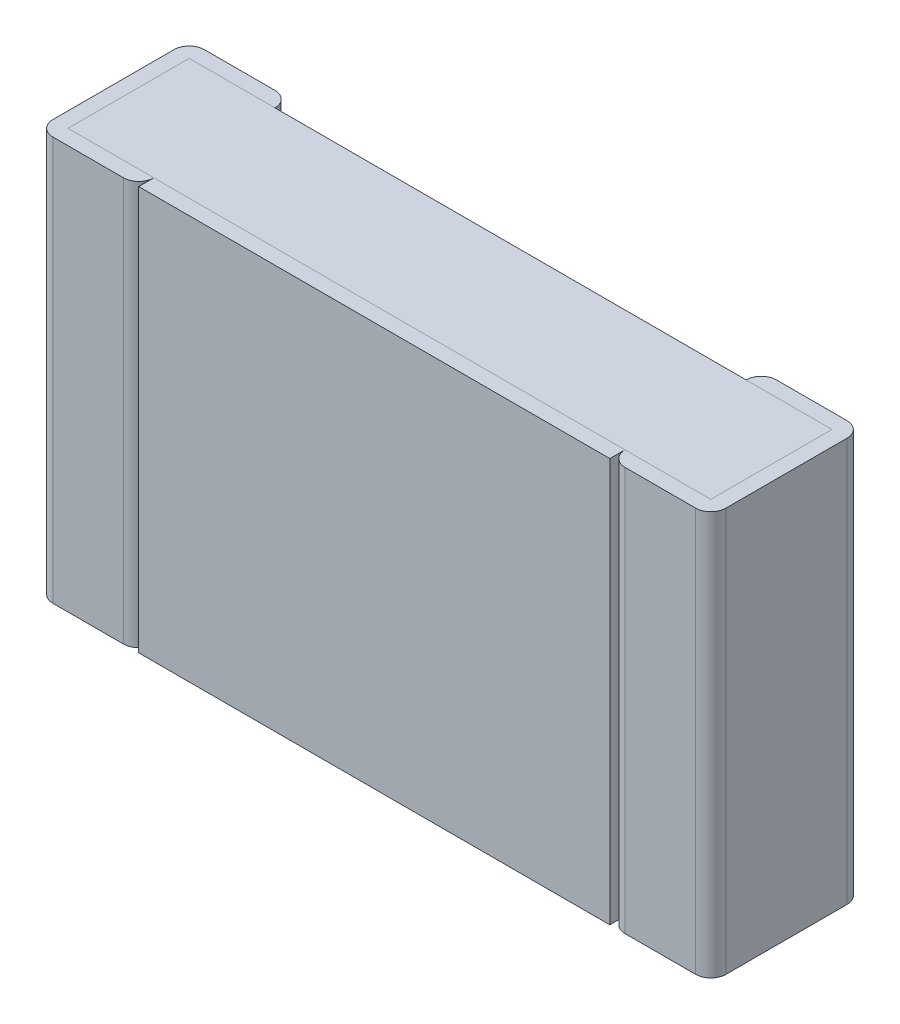
ISO-10303-21;
HEADER;
FILE_DESCRIPTION(('STEP AP214'),'2;1');
FILE_NAME('part.step','',(''),(''),'','','');
FILE_SCHEMA(('AUTOMOTIVE_DESIGN { 1 0 10303 214 1 1 1 1 }'));
ENDSEC;
DATA;
#1=APPLICATION_CONTEXT('core data for automotive mechanical design processes');
#2=APPLICATION_PROTOCOL_DEFINITION('international standard','automotive_design',2000,#1);
#3=PRODUCT_CONTEXT('',#1,'mechanical');
#4=PRODUCT('Part','Part','',(#3));
#5=PRODUCT_RELATED_PRODUCT_CATEGORY('part','',(#4));
#6=PRODUCT_DEFINITION_FORMATION('','',#4);
#7=PRODUCT_DEFINITION_CONTEXT('part definition',#1,'design');
#8=PRODUCT_DEFINITION('design','',#6,#7);
#9=PRODUCT_DEFINITION_SHAPE('','',#8);
#10=(LENGTH_UNIT() NAMED_UNIT(*) SI_UNIT(.MILLI.,.METRE.));
#11=(NAMED_UNIT(*) PLANE_ANGLE_UNIT() SI_UNIT($,.RADIAN.));
#12=(NAMED_UNIT(*) SI_UNIT($,.STERADIAN.) SOLID_ANGLE_UNIT());
#13=UNCERTAINTY_MEASURE_WITH_UNIT(LENGTH_MEASURE(1.E-05),#10,'distance_accuracy_value','');
#14=(GEOMETRIC_REPRESENTATION_CONTEXT(3) GLOBAL_UNCERTAINTY_ASSIGNED_CONTEXT((#13)) GLOBAL_UNIT_ASSIGNED_CONTEXT((#10,
#11,#12)) REPRESENTATION_CONTEXT('',''));
#15=CARTESIAN_POINT('',(0.,0.,0.));
#16=DIRECTION('',(0.,0.,1.));
#17=DIRECTION('',(1.,0.,0.));
#18=AXIS2_PLACEMENT_3D('',#15,#16,#17);
#19=CARTESIAN_POINT('',(-1.,-0.6,0.));
#20=DIRECTION('',(1.,0.,0.));
#21=DIRECTION('',(0.,1.,0.));
#22=AXIS2_PLACEMENT_3D('',#19,#20,#21);
#23=PLANE('',#22);
#24=DIRECTION('',(0.,1.,0.));
#25=VECTOR('',#24,1.);
#26=CARTESIAN_POINT('',(-1.,-0.6,0.405));
#27=LINE('',#26,#25);
#28=CARTESIAN_POINT('',(-1.,-0.6,0.405));
#29=VERTEX_POINT('',#28);
#30=CARTESIAN_POINT('',(-1.,0.6,0.405));
#31=VERTEX_POINT('',#30);
#32=EDGE_CURVE('E11',#29,#31,#27,.T.);
#33=ORIENTED_EDGE('',*,*,#32,.T.);
#34=DIRECTION('',(0.,0.,1.));
#35=VECTOR('',#34,1.);
#36=CARTESIAN_POINT('',(-1.,0.6,0.));
#37=LINE('',#36,#35);
#38=CARTESIAN_POINT('',(-1.,0.6,0.045));
#39=VERTEX_POINT('',#38);
#40=EDGE_CURVE('E41',#39,#31,#37,.T.);
#41=ORIENTED_EDGE('',*,*,#40,.F.);
#42=DIRECTION('',(0.,1.,0.));
#43=VECTOR('',#42,1.);
#44=CARTESIAN_POINT('',(-1.,-0.6,0.045));
#45=LINE('',#44,#43);
#46=CARTESIAN_POINT('',(-1.,-0.6,0.045));
#47=VERTEX_POINT('',#46);
#48=EDGE_CURVE('E271',#47,#39,#45,.T.);
#49=ORIENTED_EDGE('',*,*,#48,.F.);
#50=DIRECTION('',(0.,0.,1.));
#51=VECTOR('',#50,1.);
#52=CARTESIAN_POINT('',(-1.,-0.6,0.));
#53=LINE('',#52,#51);
#54=EDGE_CURVE('E27',#47,#29,#53,.T.);
#55=ORIENTED_EDGE('',*,*,#54,.T.);
#56=EDGE_LOOP('',(#33,#41,#49,#55));
#57=FACE_BOUND('',#56,.T.);
#58=ADVANCED_FACE('F16',(#57),#23,.F.);
#59=CARTESIAN_POINT('',(-1.,-0.6,0.));
#60=DIRECTION('',(0.,1.,0.));
#61=DIRECTION('',(1.,0.,0.));
#62=AXIS2_PLACEMENT_3D('',#59,#60,#61);
#63=PLANE('',#62);
#64=CARTESIAN_POINT('',(-0.745,-0.6,0.045));
#65=DIRECTION('',(0.,1.,0.));
#66=DIRECTION('',(0.,0.,1.));
#67=AXIS2_PLACEMENT_3D('',#64,#65,#66);
#68=CIRCLE('',#67,0.045);
#69=CARTESIAN_POINT('',(-0.7,-0.6,0.045));
#70=VERTEX_POINT('',#69);
#71=CARTESIAN_POINT('',(-0.745,-0.6,0.));
#72=VERTEX_POINT('',#71);
#73=EDGE_CURVE('E300',#70,#72,#68,.T.);
#74=ORIENTED_EDGE('',*,*,#73,.F.);
#75=DIRECTION('',(1.,0.,0.));
#76=VECTOR('',#75,1.);
#77=CARTESIAN_POINT('',(-0.955,-0.6,0.045));
#78=LINE('',#77,#76);
#79=CARTESIAN_POINT('',(-0.955,-0.6,0.045));
#80=VERTEX_POINT('',#79);
#81=EDGE_CURVE('E438',#80,#70,#78,.T.);
#82=ORIENTED_EDGE('',*,*,#81,.F.);
#83=DIRECTION('',(0.,0.,1.));
#84=VECTOR('',#83,1.);
#85=CARTESIAN_POINT('',(-0.955,-0.6,0.045));
#86=LINE('',#85,#84);
#87=CARTESIAN_POINT('',(-0.955,-0.6,0.405));
#88=VERTEX_POINT('',#87);
#89=EDGE_CURVE('E362',#80,#88,#86,.T.);
#90=ORIENTED_EDGE('',*,*,#89,.T.);
#91=DIRECTION('',(1.,0.,0.));
#92=VECTOR('',#91,1.);
#93=CARTESIAN_POINT('',(-0.955,-0.6,0.405));
#94=LINE('',#93,#92);
#95=CARTESIAN_POINT('',(-0.7,-0.6,0.405));
#96=VERTEX_POINT('',#95);
#97=EDGE_CURVE('E365',#88,#96,#94,.T.);
#98=ORIENTED_EDGE('',*,*,#97,.T.);
#99=CARTESIAN_POINT('',(-0.745,-0.6,0.405));
#100=DIRECTION('',(0.,-1.,0.));
#101=DIRECTION('',(0.,0.,1.));
#102=AXIS2_PLACEMENT_3D('',#99,#100,#101);
#103=CIRCLE('',#102,0.045);
#104=CARTESIAN_POINT('',(-0.745,-0.6,0.45));
#105=VERTEX_POINT('',#104);
#106=EDGE_CURVE('E393',#96,#105,#103,.T.);
#107=ORIENTED_EDGE('',*,*,#106,.T.);
#108=DIRECTION('',(1.,0.,0.));
#109=VECTOR('',#108,1.);
#110=CARTESIAN_POINT('',(-1.,-0.6,0.45));
#111=LINE('',#110,#109);
#112=CARTESIAN_POINT('',(-0.955,-0.6,0.45));
#113=VERTEX_POINT('',#112);
#114=EDGE_CURVE('E422',#113,#105,#111,.T.);
#115=ORIENTED_EDGE('',*,*,#114,.F.);
#116=CARTESIAN_POINT('',(-0.955,-0.6,0.405));
#117=DIRECTION('',(0.,1.,0.));
#118=DIRECTION('',(0.,0.,1.));
#119=AXIS2_PLACEMENT_3D('',#116,#117,#118);
#120=CIRCLE('',#119,0.045);
#121=EDGE_CURVE('E262',#29,#113,#120,.T.);
#122=ORIENTED_EDGE('',*,*,#121,.F.);
#123=ORIENTED_EDGE('',*,*,#54,.F.);
#124=CARTESIAN_POINT('',(-0.955,-0.6,0.045));
#125=DIRECTION('',(0.,-1.,0.));
#126=DIRECTION('',(0.,0.,1.));
#127=AXIS2_PLACEMENT_3D('',#124,#125,#126);
#128=CIRCLE('',#127,0.045);
#129=CARTESIAN_POINT('',(-0.955,-0.6,0.));
#130=VERTEX_POINT('',#129);
#131=EDGE_CURVE('E321',#47,#130,#128,.T.);
#132=ORIENTED_EDGE('',*,*,#131,.T.);
#133=DIRECTION('',(1.,0.,0.));
#134=VECTOR('',#133,1.);
#135=CARTESIAN_POINT('',(-1.,-0.6,0.));
#136=LINE('',#135,#134);
#137=EDGE_CURVE('E318',#130,#72,#136,.T.);
#138=ORIENTED_EDGE('',*,*,#137,.T.);
#139=EDGE_LOOP('',(#74,#82,#90,#98,#107,#115,#122,#123,#132,#138));
#140=FACE_BOUND('',#139,.T.);
#141=ADVANCED_FACE('F474',(#140),#63,.F.);
#142=CARTESIAN_POINT('',(-0.955,-0.6,0.045));
#143=DIRECTION('',(0.,1.,0.));
#144=DIRECTION('',(-1.,0.,0.));
#145=AXIS2_PLACEMENT_3D('',#142,#143,#144);
#146=CYLINDRICAL_SURFACE('',#145,0.045);
#147=ORIENTED_EDGE('',*,*,#48,.T.);
#148=CARTESIAN_POINT('',(-0.955,0.6,0.045));
#149=DIRECTION('',(0.,-1.,0.));
#150=DIRECTION('',(0.,0.,1.));
#151=AXIS2_PLACEMENT_3D('',#148,#149,#150);
#152=CIRCLE('',#151,0.045);
#153=CARTESIAN_POINT('',(-0.955,0.6,0.));
#154=VERTEX_POINT('',#153);
#155=EDGE_CURVE('E267',#39,#154,#152,.T.);
#156=ORIENTED_EDGE('',*,*,#155,.T.);
#157=DIRECTION('',(0.,1.,0.));
#158=VECTOR('',#157,1.);
#159=CARTESIAN_POINT('',(-0.955,-0.6,0.));
#160=LINE('',#159,#158);
#161=EDGE_CURVE('E313',#130,#154,#160,.T.);
#162=ORIENTED_EDGE('',*,*,#161,.F.);
#163=ORIENTED_EDGE('',*,*,#131,.F.);
#164=EDGE_LOOP('',(#147,#156,#162,#163));
#165=FACE_BOUND('',#164,.T.);
#166=ADVANCED_FACE('F492',(#165),#146,.T.);
#167=CARTESIAN_POINT('',(-0.955,-0.6,0.405));
#168=DIRECTION('',(0.,1.,0.));
#169=DIRECTION('',(-1.,0.,0.));
#170=AXIS2_PLACEMENT_3D('',#167,#168,#169);
#171=CYLINDRICAL_SURFACE('',#170,0.045);
#172=ORIENTED_EDGE('',*,*,#121,.T.);
#173=DIRECTION('',(0.,1.,0.));
#174=VECTOR('',#173,1.);
#175=CARTESIAN_POINT('',(-0.955,-0.6,0.45));
#176=LINE('',#175,#174);
#177=CARTESIAN_POINT('',(-0.955,0.6,0.45));
#178=VERTEX_POINT('',#177);
#179=EDGE_CURVE('E258',#113,#178,#176,.T.);
#180=ORIENTED_EDGE('',*,*,#179,.T.);
#181=CARTESIAN_POINT('',(-0.955,0.6,0.405));
#182=DIRECTION('',(0.,1.,0.));
#183=DIRECTION('',(0.,0.,1.));
#184=AXIS2_PLACEMENT_3D('',#181,#182,#183);
#185=CIRCLE('',#184,0.045);
#186=EDGE_CURVE('E379',#31,#178,#185,.T.);
#187=ORIENTED_EDGE('',*,*,#186,.F.);
#188=ORIENTED_EDGE('',*,*,#32,.F.);
#189=EDGE_LOOP('',(#172,#180,#187,#188));
#190=FACE_BOUND('',#189,.T.);
#191=ADVANCED_FACE('F486',(#190),#171,.T.);
#192=CARTESIAN_POINT('',(-1.,0.6,0.));
#193=DIRECTION('',(0.,1.,0.));
#194=DIRECTION('',(1.,0.,0.));
#195=AXIS2_PLACEMENT_3D('',#192,#193,#194);
#196=PLANE('',#195);
#197=DIRECTION('',(1.,0.,0.));
#198=VECTOR('',#197,1.);
#199=CARTESIAN_POINT('',(-1.,0.6,0.));
#200=LINE('',#199,#198);
#201=CARTESIAN_POINT('',(-0.745,0.6,0.));
#202=VERTEX_POINT('',#201);
#203=EDGE_CURVE('E303',#154,#202,#200,.T.);
#204=ORIENTED_EDGE('',*,*,#203,.F.);
#205=ORIENTED_EDGE('',*,*,#155,.F.);
#206=ORIENTED_EDGE('',*,*,#40,.T.);
#207=ORIENTED_EDGE('',*,*,#186,.T.);
#208=DIRECTION('',(1.,0.,0.));
#209=VECTOR('',#208,1.);
#210=CARTESIAN_POINT('',(-1.,0.6,0.45));
#211=LINE('',#210,#209);
#212=CARTESIAN_POINT('',(-0.745,0.6,0.45));
#213=VERTEX_POINT('',#212);
#214=EDGE_CURVE('E360',#178,#213,#211,.T.);
#215=ORIENTED_EDGE('',*,*,#214,.T.);
#216=CARTESIAN_POINT('',(-0.745,0.6,0.405));
#217=DIRECTION('',(0.,-1.,0.));
#218=DIRECTION('',(0.,0.,1.));
#219=AXIS2_PLACEMENT_3D('',#216,#217,#218);
#220=CIRCLE('',#219,0.045);
#221=CARTESIAN_POINT('',(-0.7,0.6,0.405));
#222=VERTEX_POINT('',#221);
#223=EDGE_CURVE('E295',#222,#213,#220,.T.);
#224=ORIENTED_EDGE('',*,*,#223,.F.);
#225=DIRECTION('',(1.,0.,0.));
#226=VECTOR('',#225,1.);
#227=CARTESIAN_POINT('',(-0.955,0.6,0.405));
#228=LINE('',#227,#226);
#229=CARTESIAN_POINT('',(-0.955,0.6,0.405));
#230=VERTEX_POINT('',#229);
#231=EDGE_CURVE('E296',#230,#222,#228,.T.);
#232=ORIENTED_EDGE('',*,*,#231,.F.);
#233=DIRECTION('',(0.,0.,1.));
#234=VECTOR('',#233,1.);
#235=CARTESIAN_POINT('',(-0.955,0.6,0.045));
#236=LINE('',#235,#234);
#237=CARTESIAN_POINT('',(-0.955,0.6,0.045));
#238=VERTEX_POINT('',#237);
#239=EDGE_CURVE('E291',#238,#230,#236,.T.);
#240=ORIENTED_EDGE('',*,*,#239,.F.);
#241=DIRECTION('',(1.,0.,0.));
#242=VECTOR('',#241,1.);
#243=CARTESIAN_POINT('',(-0.955,0.6,0.045));
#244=LINE('',#243,#242);
#245=CARTESIAN_POINT('',(-0.7,0.6,0.045));
#246=VERTEX_POINT('',#245);
#247=EDGE_CURVE('E356',#238,#246,#244,.T.);
#248=ORIENTED_EDGE('',*,*,#247,.T.);
#249=CARTESIAN_POINT('',(-0.745,0.6,0.045));
#250=DIRECTION('',(0.,1.,0.));
#251=DIRECTION('',(0.,0.,1.));
#252=AXIS2_PLACEMENT_3D('',#249,#250,#251);
#253=CIRCLE('',#252,0.045);
#254=EDGE_CURVE('E361',#246,#202,#253,.T.);
#255=ORIENTED_EDGE('',*,*,#254,.T.);
#256=EDGE_LOOP('',(#204,#205,#206,#207,#215,#224,#232,#240,#248,#255));
#257=FACE_BOUND('',#256,.T.);
#258=ADVANCED_FACE('F482',(#257),#196,.T.);
#259=CARTESIAN_POINT('',(-1.,-0.6,0.));
#260=DIRECTION('',(0.,0.,1.));
#261=DIRECTION('',(1.,0.,0.));
#262=AXIS2_PLACEMENT_3D('',#259,#260,#261);
#263=PLANE('',#262);
#264=DIRECTION('',(0.,1.,0.));
#265=VECTOR('',#264,1.);
#266=CARTESIAN_POINT('',(-0.745,-0.6,0.));
#267=LINE('',#266,#265);
#268=EDGE_CURVE('E304',#72,#202,#267,.T.);
#269=ORIENTED_EDGE('',*,*,#268,.F.);
#270=ORIENTED_EDGE('',*,*,#137,.F.);
#271=ORIENTED_EDGE('',*,*,#161,.T.);
#272=ORIENTED_EDGE('',*,*,#203,.T.);
#273=EDGE_LOOP('',(#269,#270,#271,#272));
#274=FACE_BOUND('',#273,.T.);
#275=ADVANCED_FACE('F495',(#274),#263,.F.);
#276=CARTESIAN_POINT('',(-0.745,-0.6,0.045));
#277=DIRECTION('',(0.,1.,0.));
#278=DIRECTION('',(1.,0.,0.));
#279=AXIS2_PLACEMENT_3D('',#276,#277,#278);
#280=CYLINDRICAL_SURFACE('',#279,0.045);
#281=ORIENTED_EDGE('',*,*,#73,.T.);
#282=ORIENTED_EDGE('',*,*,#268,.T.);
#283=ORIENTED_EDGE('',*,*,#254,.F.);
#284=DIRECTION('',(0.,1.,0.));
#285=VECTOR('',#284,1.);
#286=CARTESIAN_POINT('',(-0.7,-0.6,0.045));
#287=LINE('',#286,#285);
#288=EDGE_CURVE('E281',#70,#246,#287,.T.);
#289=ORIENTED_EDGE('',*,*,#288,.F.);
#290=EDGE_LOOP('',(#281,#282,#283,#289));
#291=FACE_BOUND('',#290,.T.);
#292=ADVANCED_FACE('F585',(#291),#280,.T.);
#293=CARTESIAN_POINT('',(-0.955,-0.6,0.045));
#294=DIRECTION('',(0.,1.,0.));
#295=DIRECTION('',(1.,0.,0.));
#296=AXIS2_PLACEMENT_3D('',#293,#294,#295);
#297=PLANE('',#296);
#298=DIRECTION('',(1.,0.,0.));
#299=VECTOR('',#298,1.);
#300=CARTESIAN_POINT('',(-0.955,-0.6,0.045));
#301=LINE('',#300,#299);
#302=CARTESIAN_POINT('',(0.7,-0.6,0.045));
#303=VERTEX_POINT('',#302);
#304=EDGE_CURVE('E389',#70,#303,#301,.T.);
#305=ORIENTED_EDGE('',*,*,#304,.T.);
#306=DIRECTION('',(1.,0.,0.));
#307=VECTOR('',#306,1.);
#308=CARTESIAN_POINT('',(-0.955,-0.6,0.045));
#309=LINE('',#308,#307);
#310=CARTESIAN_POINT('',(0.955,-0.6,0.045));
#311=VERTEX_POINT('',#310);
#312=EDGE_CURVE('E245',#303,#311,#309,.T.);
#313=ORIENTED_EDGE('',*,*,#312,.T.);
#314=DIRECTION('',(0.,0.,1.));
#315=VECTOR('',#314,1.);
#316=CARTESIAN_POINT('',(0.955,-0.6,0.045));
#317=LINE('',#316,#315);
#318=CARTESIAN_POINT('',(0.955,-0.6,0.405));
#319=VERTEX_POINT('',#318);
#320=EDGE_CURVE('E442',#311,#319,#317,.T.);
#321=ORIENTED_EDGE('',*,*,#320,.T.);
#322=DIRECTION('',(1.,0.,0.));
#323=VECTOR('',#322,1.);
#324=CARTESIAN_POINT('',(-0.955,-0.6,0.405));
#325=LINE('',#324,#323);
#326=CARTESIAN_POINT('',(0.7,-0.6,0.405));
#327=VERTEX_POINT('',#326);
#328=EDGE_CURVE('E232',#327,#319,#325,.T.);
#329=ORIENTED_EDGE('',*,*,#328,.F.);
#330=DIRECTION('',(1.,0.,0.));
#331=VECTOR('',#330,1.);
#332=CARTESIAN_POINT('',(-0.7,-0.6,0.405));
#333=LINE('',#332,#331);
#334=EDGE_CURVE('E251',#96,#327,#333,.T.);
#335=ORIENTED_EDGE('',*,*,#334,.F.);
#336=ORIENTED_EDGE('',*,*,#97,.F.);
#337=ORIENTED_EDGE('',*,*,#89,.F.);
#338=ORIENTED_EDGE('',*,*,#81,.T.);
#339=EDGE_LOOP('',(#305,#313,#321,#329,#335,#336,#337,#338));
#340=FACE_BOUND('',#339,.T.);
#341=ADVANCED_FACE('F505',(#340),#297,.F.);
#342=CARTESIAN_POINT('',(-1.,-0.6,0.45));
#343=DIRECTION('',(0.,0.,1.));
#344=DIRECTION('',(1.,0.,0.));
#345=AXIS2_PLACEMENT_3D('',#342,#343,#344);
#346=PLANE('',#345);
#347=ORIENTED_EDGE('',*,*,#214,.F.);
#348=ORIENTED_EDGE('',*,*,#179,.F.);
#349=ORIENTED_EDGE('',*,*,#114,.T.);
#350=DIRECTION('',(0.,1.,0.));
#351=VECTOR('',#350,1.);
#352=CARTESIAN_POINT('',(-0.745,-0.6,0.45));
#353=LINE('',#352,#351);
#354=EDGE_CURVE('E355',#105,#213,#353,.T.);
#355=ORIENTED_EDGE('',*,*,#354,.T.);
#356=EDGE_LOOP('',(#347,#348,#349,#355));
#357=FACE_BOUND('',#356,.T.);
#358=ADVANCED_FACE('F468',(#357),#346,.T.);
#359=CARTESIAN_POINT('',(-0.745,-0.6,0.405));
#360=DIRECTION('',(0.,1.,0.));
#361=DIRECTION('',(1.,0.,0.));
#362=AXIS2_PLACEMENT_3D('',#359,#360,#361);
#363=CYLINDRICAL_SURFACE('',#362,0.045);
#364=DIRECTION('',(0.,1.,0.));
#365=VECTOR('',#364,1.);
#366=CARTESIAN_POINT('',(-0.7,-0.6,0.405));
#367=LINE('',#366,#365);
#368=EDGE_CURVE('E352',#96,#222,#367,.T.);
#369=ORIENTED_EDGE('',*,*,#368,.T.);
#370=ORIENTED_EDGE('',*,*,#223,.T.);
#371=ORIENTED_EDGE('',*,*,#354,.F.);
#372=ORIENTED_EDGE('',*,*,#106,.F.);
#373=EDGE_LOOP('',(#369,#370,#371,#372));
#374=FACE_BOUND('',#373,.T.);
#375=ADVANCED_FACE('F478',(#374),#363,.T.);
#376=CARTESIAN_POINT('',(-0.955,0.6,0.045));
#377=DIRECTION('',(0.,1.,0.));
#378=DIRECTION('',(1.,0.,0.));
#379=AXIS2_PLACEMENT_3D('',#376,#377,#378);
#380=PLANE('',#379);
#381=ORIENTED_EDGE('',*,*,#247,.F.);
#382=ORIENTED_EDGE('',*,*,#239,.T.);
#383=ORIENTED_EDGE('',*,*,#231,.T.);
#384=DIRECTION('',(1.,0.,0.));
#385=VECTOR('',#384,1.);
#386=CARTESIAN_POINT('',(-0.7,0.6,0.405));
#387=LINE('',#386,#385);
#388=CARTESIAN_POINT('',(0.7,0.6,0.405));
#389=VERTEX_POINT('',#388);
#390=EDGE_CURVE('E286',#222,#389,#387,.T.);
#391=ORIENTED_EDGE('',*,*,#390,.T.);
#392=DIRECTION('',(1.,0.,0.));
#393=VECTOR('',#392,1.);
#394=CARTESIAN_POINT('',(-0.955,0.6,0.405));
#395=LINE('',#394,#393);
#396=CARTESIAN_POINT('',(0.955,0.6,0.405));
#397=VERTEX_POINT('',#396);
#398=EDGE_CURVE('E283',#389,#397,#395,.T.);
#399=ORIENTED_EDGE('',*,*,#398,.T.);
#400=DIRECTION('',(0.,0.,1.));
#401=VECTOR('',#400,1.);
#402=CARTESIAN_POINT('',(0.955,0.6,0.045));
#403=LINE('',#402,#401);
#404=CARTESIAN_POINT('',(0.955,0.6,0.045));
#405=VERTEX_POINT('',#404);
#406=EDGE_CURVE('E332',#405,#397,#403,.T.);
#407=ORIENTED_EDGE('',*,*,#406,.F.);
#408=DIRECTION('',(1.,0.,0.));
#409=VECTOR('',#408,1.);
#410=CARTESIAN_POINT('',(-0.955,0.6,0.045));
#411=LINE('',#410,#409);
#412=CARTESIAN_POINT('',(0.7,0.6,0.045));
#413=VERTEX_POINT('',#412);
#414=EDGE_CURVE('E327',#413,#405,#411,.T.);
#415=ORIENTED_EDGE('',*,*,#414,.F.);
#416=DIRECTION('',(1.,0.,0.));
#417=VECTOR('',#416,1.);
#418=CARTESIAN_POINT('',(-0.955,0.6,0.045));
#419=LINE('',#418,#417);
#420=EDGE_CURVE('E287',#246,#413,#419,.T.);
#421=ORIENTED_EDGE('',*,*,#420,.F.);
#422=EDGE_LOOP('',(#381,#382,#383,#391,#399,#407,#415,#421));
#423=FACE_BOUND('',#422,.T.);
#424=ADVANCED_FACE('F560',(#423),#380,.T.);
#425=CARTESIAN_POINT('',(-0.955,-0.6,0.045));
#426=DIRECTION('',(0.,0.,1.));
#427=DIRECTION('',(1.,0.,0.));
#428=AXIS2_PLACEMENT_3D('',#425,#426,#427);
#429=PLANE('',#428);
#430=ORIENTED_EDGE('',*,*,#420,.T.);
#431=DIRECTION('',(0.,1.,0.));
#432=VECTOR('',#431,1.);
#433=CARTESIAN_POINT('',(0.7,-0.6,0.045));
#434=LINE('',#433,#432);
#435=EDGE_CURVE('E257',#303,#413,#434,.T.);
#436=ORIENTED_EDGE('',*,*,#435,.F.);
#437=ORIENTED_EDGE('',*,*,#304,.F.);
#438=ORIENTED_EDGE('',*,*,#288,.T.);
#439=EDGE_LOOP('',(#430,#436,#437,#438));
#440=FACE_BOUND('',#439,.T.);
#441=ADVANCED_FACE('F18',(#440),#429,.F.);
#442=CARTESIAN_POINT('',(0.7,-0.6,0.));
#443=DIRECTION('',(0.,1.,0.));
#444=DIRECTION('',(1.,0.,0.));
#445=AXIS2_PLACEMENT_3D('',#442,#443,#444);
#446=PLANE('',#445);
#447=CARTESIAN_POINT('',(0.955,-0.6,0.045));
#448=DIRECTION('',(0.,1.,0.));
#449=DIRECTION('',(0.,0.,1.));
#450=AXIS2_PLACEMENT_3D('',#447,#448,#449);
#451=CIRCLE('',#450,0.045);
#452=CARTESIAN_POINT('',(1.,-0.6,0.045));
#453=VERTEX_POINT('',#452);
#454=CARTESIAN_POINT('',(0.955,-0.6,0.));
#455=VERTEX_POINT('',#454);
#456=EDGE_CURVE('E305',#453,#455,#451,.T.);
#457=ORIENTED_EDGE('',*,*,#456,.F.);
#458=DIRECTION('',(0.,0.,1.));
#459=VECTOR('',#458,1.);
#460=CARTESIAN_POINT('',(1.,-0.6,0.));
#461=LINE('',#460,#459);
#462=CARTESIAN_POINT('',(1.,-0.6,0.405));
#463=VERTEX_POINT('',#462);
#464=EDGE_CURVE('E229',#453,#463,#461,.T.);
#465=ORIENTED_EDGE('',*,*,#464,.T.);
#466=CARTESIAN_POINT('',(0.955,-0.6,0.405));
#467=DIRECTION('',(0.,-1.,0.));
#468=DIRECTION('',(0.,0.,1.));
#469=AXIS2_PLACEMENT_3D('',#466,#467,#468);
#470=CIRCLE('',#469,0.045);
#471=CARTESIAN_POINT('',(0.955,-0.6,0.45));
#472=VERTEX_POINT('',#471);
#473=EDGE_CURVE('E226',#463,#472,#470,.T.);
#474=ORIENTED_EDGE('',*,*,#473,.T.);
#475=DIRECTION('',(1.,0.,0.));
#476=VECTOR('',#475,1.);
#477=CARTESIAN_POINT('',(0.7,-0.6,0.45));
#478=LINE('',#477,#476);
#479=CARTESIAN_POINT('',(0.745,-0.6,0.45));
#480=VERTEX_POINT('',#479);
#481=EDGE_CURVE('E216',#480,#472,#478,.T.);
#482=ORIENTED_EDGE('',*,*,#481,.F.);
#483=CARTESIAN_POINT('',(0.745,-0.6,0.405));
#484=DIRECTION('',(0.,1.,0.));
#485=DIRECTION('',(0.,0.,1.));
#486=AXIS2_PLACEMENT_3D('',#483,#484,#485);
#487=CIRCLE('',#486,0.045);
#488=EDGE_CURVE('E236',#327,#480,#487,.T.);
#489=ORIENTED_EDGE('',*,*,#488,.F.);
#490=ORIENTED_EDGE('',*,*,#328,.T.);
#491=ORIENTED_EDGE('',*,*,#320,.F.);
#492=ORIENTED_EDGE('',*,*,#312,.F.);
#493=CARTESIAN_POINT('',(0.745,-0.6,0.045));
#494=DIRECTION('',(0.,-1.,0.));
#495=DIRECTION('',(0.,0.,1.));
#496=AXIS2_PLACEMENT_3D('',#493,#494,#495);
#497=CIRCLE('',#496,0.045);
#498=CARTESIAN_POINT('',(0.745,-0.6,0.));
#499=VERTEX_POINT('',#498);
#500=EDGE_CURVE('E266',#303,#499,#497,.T.);
#501=ORIENTED_EDGE('',*,*,#500,.T.);
#502=DIRECTION('',(1.,0.,0.));
#503=VECTOR('',#502,1.);
#504=CARTESIAN_POINT('',(0.7,-0.6,0.));
#505=LINE('',#504,#503);
#506=EDGE_CURVE('E250',#499,#455,#505,.T.);
#507=ORIENTED_EDGE('',*,*,#506,.T.);
#508=EDGE_LOOP('',(#457,#465,#474,#482,#489,#490,#491,#492,#501,#507));
#509=FACE_BOUND('',#508,.T.);
#510=ADVANCED_FACE('F227',(#509),#446,.F.);
#511=CARTESIAN_POINT('',(-0.7,-0.6,0.405));
#512=DIRECTION('',(0.,1.,0.));
#513=DIRECTION('',(1.,0.,0.));
#514=AXIS2_PLACEMENT_3D('',#511,#512,#513);
#515=PLANE('',#514);
#516=DIRECTION('',(0.,0.,1.));
#517=VECTOR('',#516,1.);
#518=CARTESIAN_POINT('',(0.7,-0.6,0.405));
#519=LINE('',#518,#517);
#520=CARTESIAN_POINT('',(0.7,-0.6,0.45));
#521=VERTEX_POINT('',#520);
#522=EDGE_CURVE('E247',#327,#521,#519,.T.);
#523=ORIENTED_EDGE('',*,*,#522,.T.);
#524=DIRECTION('',(1.,0.,0.));
#525=VECTOR('',#524,1.);
#526=CARTESIAN_POINT('',(-0.7,-0.6,0.45));
#527=LINE('',#526,#525);
#528=CARTESIAN_POINT('',(-0.7,-0.6,0.45));
#529=VERTEX_POINT('',#528);
#530=EDGE_CURVE('E279',#529,#521,#527,.T.);
#531=ORIENTED_EDGE('',*,*,#530,.F.);
#532=DIRECTION('',(0.,0.,1.));
#533=VECTOR('',#532,1.);
#534=CARTESIAN_POINT('',(-0.7,-0.6,0.405));
#535=LINE('',#534,#533);
#536=EDGE_CURVE('E331',#96,#529,#535,.T.);
#537=ORIENTED_EDGE('',*,*,#536,.F.);
#538=ORIENTED_EDGE('',*,*,#334,.T.);
#539=EDGE_LOOP('',(#523,#531,#537,#538));
#540=FACE_BOUND('',#539,.T.);
#541=ADVANCED_FACE('F527',(#540),#515,.F.);
#542=CARTESIAN_POINT('',(-0.7,-0.6,0.405));
#543=DIRECTION('',(1.,0.,0.));
#544=DIRECTION('',(0.,1.,0.));
#545=AXIS2_PLACEMENT_3D('',#542,#543,#544);
#546=PLANE('',#545);
#547=DIRECTION('',(0.,1.,0.));
#548=VECTOR('',#547,1.);
#549=CARTESIAN_POINT('',(-0.7,-0.6,0.45));
#550=LINE('',#549,#548);
#551=CARTESIAN_POINT('',(-0.7,0.6,0.45));
#552=VERTEX_POINT('',#551);
#553=EDGE_CURVE('E336',#529,#552,#550,.T.);
#554=ORIENTED_EDGE('',*,*,#553,.T.);
#555=DIRECTION('',(0.,0.,1.));
#556=VECTOR('',#555,1.);
#557=CARTESIAN_POINT('',(-0.7,0.6,0.405));
#558=LINE('',#557,#556);
#559=EDGE_CURVE('E256',#222,#552,#558,.T.);
#560=ORIENTED_EDGE('',*,*,#559,.F.);
#561=ORIENTED_EDGE('',*,*,#368,.F.);
#562=ORIENTED_EDGE('',*,*,#536,.T.);
#563=EDGE_LOOP('',(#554,#560,#561,#562));
#564=FACE_BOUND('',#563,.T.);
#565=ADVANCED_FACE('F530',(#564),#546,.F.);
#566=CARTESIAN_POINT('',(0.7,0.6,0.));
#567=DIRECTION('',(0.,1.,0.));
#568=DIRECTION('',(1.,0.,0.));
#569=AXIS2_PLACEMENT_3D('',#566,#567,#568);
#570=PLANE('',#569);
#571=DIRECTION('',(1.,0.,0.));
#572=VECTOR('',#571,1.);
#573=CARTESIAN_POINT('',(0.7,0.6,0.));
#574=LINE('',#573,#572);
#575=CARTESIAN_POINT('',(0.745,0.6,0.));
#576=VERTEX_POINT('',#575);
#577=CARTESIAN_POINT('',(0.955,0.6,0.));
#578=VERTEX_POINT('',#577);
#579=EDGE_CURVE('E308',#576,#578,#574,.T.);
#580=ORIENTED_EDGE('',*,*,#579,.F.);
#581=CARTESIAN_POINT('',(0.745,0.6,0.045));
#582=DIRECTION('',(0.,-1.,0.));
#583=DIRECTION('',(0.,0.,1.));
#584=AXIS2_PLACEMENT_3D('',#581,#582,#583);
#585=CIRCLE('',#584,0.045);
#586=EDGE_CURVE('E290',#413,#576,#585,.T.);
#587=ORIENTED_EDGE('',*,*,#586,.F.);
#588=ORIENTED_EDGE('',*,*,#414,.T.);
#589=ORIENTED_EDGE('',*,*,#406,.T.);
#590=ORIENTED_EDGE('',*,*,#398,.F.);
#591=CARTESIAN_POINT('',(0.745,0.6,0.405));
#592=DIRECTION('',(0.,1.,0.));
#593=DIRECTION('',(0.,0.,1.));
#594=AXIS2_PLACEMENT_3D('',#591,#592,#593);
#595=CIRCLE('',#594,0.045);
#596=CARTESIAN_POINT('',(0.745,0.6,0.45));
#597=VERTEX_POINT('',#596);
#598=EDGE_CURVE('E317',#389,#597,#595,.T.);
#599=ORIENTED_EDGE('',*,*,#598,.T.);
#600=DIRECTION('',(1.,0.,0.));
#601=VECTOR('',#600,1.);
#602=CARTESIAN_POINT('',(0.7,0.6,0.45));
#603=LINE('',#602,#601);
#604=CARTESIAN_POINT('',(0.955,0.6,0.45));
#605=VERTEX_POINT('',#604);
#606=EDGE_CURVE('E314',#597,#605,#603,.T.);
#607=ORIENTED_EDGE('',*,*,#606,.T.);
#608=CARTESIAN_POINT('',(0.955,0.6,0.405));
#609=DIRECTION('',(0.,-1.,0.));
#610=DIRECTION('',(0.,0.,1.));
#611=AXIS2_PLACEMENT_3D('',#608,#609,#610);
#612=CIRCLE('',#611,0.045);
#613=CARTESIAN_POINT('',(1.,0.6,0.405));
#614=VERTEX_POINT('',#613);
#615=EDGE_CURVE('E157',#614,#605,#612,.T.);
#616=ORIENTED_EDGE('',*,*,#615,.F.);
#617=DIRECTION('',(0.,0.,1.));
#618=VECTOR('',#617,1.);
#619=CARTESIAN_POINT('',(1.,0.6,0.));
#620=LINE('',#619,#618);
#621=CARTESIAN_POINT('',(1.,0.6,0.045));
#622=VERTEX_POINT('',#621);
#623=EDGE_CURVE('E413',#622,#614,#620,.T.);
#624=ORIENTED_EDGE('',*,*,#623,.F.);
#625=CARTESIAN_POINT('',(0.955,0.6,0.045));
#626=DIRECTION('',(0.,1.,0.));
#627=DIRECTION('',(0.,0.,1.));
#628=AXIS2_PLACEMENT_3D('',#625,#626,#627);
#629=CIRCLE('',#628,0.045);
#630=EDGE_CURVE('E298',#622,#578,#629,.T.);
#631=ORIENTED_EDGE('',*,*,#630,.T.);
#632=EDGE_LOOP('',(#580,#587,#588,#589,#590,#599,#607,#616,#624,#631));
#633=FACE_BOUND('',#632,.T.);
#634=ADVANCED_FACE('F537',(#633),#570,.T.);
#635=CARTESIAN_POINT('',(-0.7,0.6,0.405));
#636=DIRECTION('',(0.,1.,0.));
#637=DIRECTION('',(1.,0.,0.));
#638=AXIS2_PLACEMENT_3D('',#635,#636,#637);
#639=PLANE('',#638);
#640=ORIENTED_EDGE('',*,*,#390,.F.);
#641=ORIENTED_EDGE('',*,*,#559,.T.);
#642=DIRECTION('',(1.,0.,0.));
#643=VECTOR('',#642,1.);
#644=CARTESIAN_POINT('',(-0.7,0.6,0.45));
#645=LINE('',#644,#643);
#646=CARTESIAN_POINT('',(0.7,0.6,0.45));
#647=VERTEX_POINT('',#646);
#648=EDGE_CURVE('E252',#552,#647,#645,.T.);
#649=ORIENTED_EDGE('',*,*,#648,.T.);
#650=DIRECTION('',(0.,0.,1.));
#651=VECTOR('',#650,1.);
#652=CARTESIAN_POINT('',(0.7,0.6,0.405));
#653=LINE('',#652,#651);
#654=EDGE_CURVE('E275',#389,#647,#653,.T.);
#655=ORIENTED_EDGE('',*,*,#654,.F.);
#656=EDGE_LOOP('',(#640,#641,#649,#655));
#657=FACE_BOUND('',#656,.T.);
#658=ADVANCED_FACE('F535',(#657),#639,.T.);
#659=CARTESIAN_POINT('',(0.745,-0.6,0.045));
#660=DIRECTION('',(0.,1.,0.));
#661=DIRECTION('',(-1.,0.,0.));
#662=AXIS2_PLACEMENT_3D('',#659,#660,#661);
#663=CYLINDRICAL_SURFACE('',#662,0.045);
#664=ORIENTED_EDGE('',*,*,#435,.T.);
#665=ORIENTED_EDGE('',*,*,#586,.T.);
#666=DIRECTION('',(0.,1.,0.));
#667=VECTOR('',#666,1.);
#668=CARTESIAN_POINT('',(0.745,-0.6,0.));
#669=LINE('',#668,#667);
#670=EDGE_CURVE('E20',#499,#576,#669,.T.);
#671=ORIENTED_EDGE('',*,*,#670,.F.);
#672=ORIENTED_EDGE('',*,*,#500,.F.);
#673=EDGE_LOOP('',(#664,#665,#671,#672));
#674=FACE_BOUND('',#673,.T.);
#675=ADVANCED_FACE('F509',(#674),#663,.T.);
#676=CARTESIAN_POINT('',(0.7,-0.6,0.));
#677=DIRECTION('',(0.,0.,1.));
#678=DIRECTION('',(1.,0.,0.));
#679=AXIS2_PLACEMENT_3D('',#676,#677,#678);
#680=PLANE('',#679);
#681=DIRECTION('',(0.,1.,0.));
#682=VECTOR('',#681,1.);
#683=CARTESIAN_POINT('',(0.955,-0.6,0.));
#684=LINE('',#683,#682);
#685=EDGE_CURVE('E309',#455,#578,#684,.T.);
#686=ORIENTED_EDGE('',*,*,#685,.F.);
#687=ORIENTED_EDGE('',*,*,#506,.F.);
#688=ORIENTED_EDGE('',*,*,#670,.T.);
#689=ORIENTED_EDGE('',*,*,#579,.T.);
#690=EDGE_LOOP('',(#686,#687,#688,#689));
#691=FACE_BOUND('',#690,.T.);
#692=ADVANCED_FACE('F545',(#691),#680,.F.);
#693=CARTESIAN_POINT('',(0.955,-0.6,0.045));
#694=DIRECTION('',(0.,1.,0.));
#695=DIRECTION('',(1.,0.,0.));
#696=AXIS2_PLACEMENT_3D('',#693,#694,#695);
#697=CYLINDRICAL_SURFACE('',#696,0.045);
#698=ORIENTED_EDGE('',*,*,#456,.T.);
#699=ORIENTED_EDGE('',*,*,#685,.T.);
#700=ORIENTED_EDGE('',*,*,#630,.F.);
#701=DIRECTION('',(0.,1.,0.));
#702=VECTOR('',#701,1.);
#703=CARTESIAN_POINT('',(1.,-0.6,0.045));
#704=LINE('',#703,#702);
#705=EDGE_CURVE('E412',#453,#622,#704,.T.);
#706=ORIENTED_EDGE('',*,*,#705,.F.);
#707=EDGE_LOOP('',(#698,#699,#700,#706));
#708=FACE_BOUND('',#707,.T.);
#709=ADVANCED_FACE('F599',(#708),#697,.T.);
#710=CARTESIAN_POINT('',(1.,-0.6,0.));
#711=DIRECTION('',(1.,0.,0.));
#712=DIRECTION('',(0.,1.,0.));
#713=AXIS2_PLACEMENT_3D('',#710,#711,#712);
#714=PLANE('',#713);
#715=ORIENTED_EDGE('',*,*,#464,.F.);
#716=ORIENTED_EDGE('',*,*,#705,.T.);
#717=ORIENTED_EDGE('',*,*,#623,.T.);
#718=DIRECTION('',(0.,1.,0.));
#719=VECTOR('',#718,1.);
#720=CARTESIAN_POINT('',(1.,-0.6,0.405));
#721=LINE('',#720,#719);
#722=EDGE_CURVE('E416',#463,#614,#721,.T.);
#723=ORIENTED_EDGE('',*,*,#722,.F.);
#724=EDGE_LOOP('',(#715,#716,#717,#723));
#725=FACE_BOUND('',#724,.T.);
#726=ADVANCED_FACE('F578',(#725),#714,.T.);
#727=CARTESIAN_POINT('',(0.955,-0.6,0.405));
#728=DIRECTION('',(0.,1.,0.));
#729=DIRECTION('',(1.,0.,0.));
#730=AXIS2_PLACEMENT_3D('',#727,#728,#729);
#731=CYLINDRICAL_SURFACE('',#730,0.045);
#732=ORIENTED_EDGE('',*,*,#722,.T.);
#733=ORIENTED_EDGE('',*,*,#615,.T.);
#734=DIRECTION('',(0.,1.,0.));
#735=VECTOR('',#734,1.);
#736=CARTESIAN_POINT('',(0.955,-0.6,0.45));
#737=LINE('',#736,#735);
#738=EDGE_CURVE('E219',#472,#605,#737,.T.);
#739=ORIENTED_EDGE('',*,*,#738,.F.);
#740=ORIENTED_EDGE('',*,*,#473,.F.);
#741=EDGE_LOOP('',(#732,#733,#739,#740));
#742=FACE_BOUND('',#741,.T.);
#743=ADVANCED_FACE('F234',(#742),#731,.T.);
#744=CARTESIAN_POINT('',(0.7,-0.6,0.45));
#745=DIRECTION('',(0.,0.,1.));
#746=DIRECTION('',(1.,0.,0.));
#747=AXIS2_PLACEMENT_3D('',#744,#745,#746);
#748=PLANE('',#747);
#749=ORIENTED_EDGE('',*,*,#606,.F.);
#750=DIRECTION('',(0.,1.,0.));
#751=VECTOR('',#750,1.);
#752=CARTESIAN_POINT('',(0.745,-0.6,0.45));
#753=LINE('',#752,#751);
#754=EDGE_CURVE('E221',#480,#597,#753,.T.);
#755=ORIENTED_EDGE('',*,*,#754,.F.);
#756=ORIENTED_EDGE('',*,*,#481,.T.);
#757=ORIENTED_EDGE('',*,*,#738,.T.);
#758=EDGE_LOOP('',(#749,#755,#756,#757));
#759=FACE_BOUND('',#758,.T.);
#760=ADVANCED_FACE('F218',(#759),#748,.T.);
#761=CARTESIAN_POINT('',(0.745,-0.6,0.405));
#762=DIRECTION('',(0.,1.,0.));
#763=DIRECTION('',(-1.,0.,0.));
#764=AXIS2_PLACEMENT_3D('',#761,#762,#763);
#765=CYLINDRICAL_SURFACE('',#764,0.045);
#766=ORIENTED_EDGE('',*,*,#488,.T.);
#767=ORIENTED_EDGE('',*,*,#754,.T.);
#768=ORIENTED_EDGE('',*,*,#598,.F.);
#769=DIRECTION('',(0.,1.,0.));
#770=VECTOR('',#769,1.);
#771=CARTESIAN_POINT('',(0.7,-0.6,0.405));
#772=LINE('',#771,#770);
#773=EDGE_CURVE('E278',#327,#389,#772,.T.);
#774=ORIENTED_EDGE('',*,*,#773,.F.);
#775=EDGE_LOOP('',(#766,#767,#768,#774));
#776=FACE_BOUND('',#775,.T.);
#777=ADVANCED_FACE('F520',(#776),#765,.T.);
#778=CARTESIAN_POINT('',(0.7,-0.6,0.405));
#779=DIRECTION('',(1.,0.,0.));
#780=DIRECTION('',(0.,1.,0.));
#781=AXIS2_PLACEMENT_3D('',#778,#779,#780);
#782=PLANE('',#781);
#783=ORIENTED_EDGE('',*,*,#522,.F.);
#784=ORIENTED_EDGE('',*,*,#773,.T.);
#785=ORIENTED_EDGE('',*,*,#654,.T.);
#786=DIRECTION('',(0.,1.,0.));
#787=VECTOR('',#786,1.);
#788=CARTESIAN_POINT('',(0.7,-0.6,0.45));
#789=LINE('',#788,#787);
#790=EDGE_CURVE('E323',#521,#647,#789,.T.);
#791=ORIENTED_EDGE('',*,*,#790,.F.);
#792=EDGE_LOOP('',(#783,#784,#785,#791));
#793=FACE_BOUND('',#792,.T.);
#794=ADVANCED_FACE('F524',(#793),#782,.T.);
#795=CARTESIAN_POINT('',(-0.7,-0.6,0.45));
#796=DIRECTION('',(0.,0.,1.));
#797=DIRECTION('',(1.,0.,0.));
#798=AXIS2_PLACEMENT_3D('',#795,#796,#797);
#799=PLANE('',#798);
#800=ORIENTED_EDGE('',*,*,#553,.F.);
#801=ORIENTED_EDGE('',*,*,#530,.T.);
#802=ORIENTED_EDGE('',*,*,#790,.T.);
#803=ORIENTED_EDGE('',*,*,#648,.F.);
#804=EDGE_LOOP('',(#800,#801,#802,#803));
#805=FACE_BOUND('',#804,.T.);
#806=ADVANCED_FACE('F533',(#805),#799,.T.);
#807=CLOSED_SHELL('',(#58,#141,#166,#191,#258,#275,#292,#341,#358,#375,#424,#441,#510,#541,#565,
#634,#658,#675,#692,#709,#726,#743,#760,#777,#794,#806));
#808=MANIFOLD_SOLID_BREP('B1',#807);
#809=ADVANCED_BREP_SHAPE_REPRESENTATION('',(#18,#808),#14);
#810=SHAPE_DEFINITION_REPRESENTATION(#9,#809);
ENDSEC;
END-ISO-10303-21;
